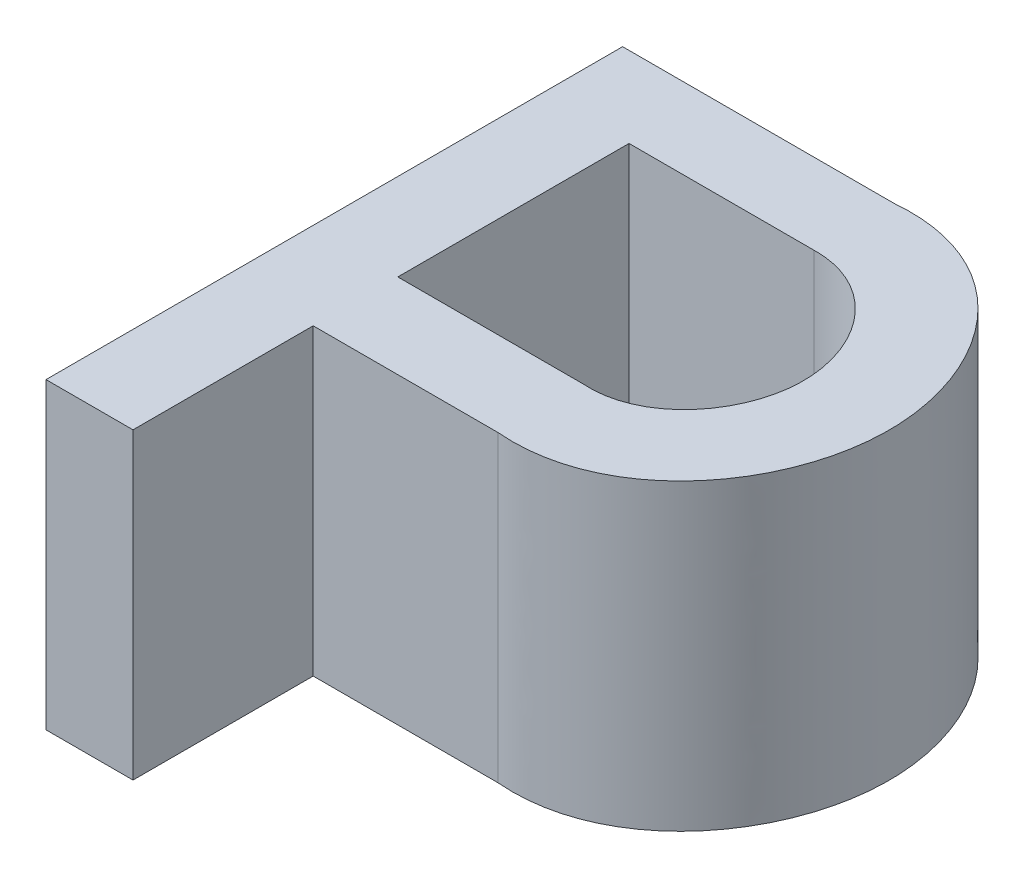
ISO-10303-21;
HEADER;
FILE_DESCRIPTION(('STEP AP214'),'2;1');
FILE_NAME('part.step','',(''),(''),'','','');
FILE_SCHEMA(('AUTOMOTIVE_DESIGN { 1 0 10303 214 1 1 1 1 }'));
ENDSEC;
DATA;
#1=APPLICATION_CONTEXT('core data for automotive mechanical design processes');
#2=APPLICATION_PROTOCOL_DEFINITION('international standard','automotive_design',2000,#1);
#3=PRODUCT_CONTEXT('',#1,'mechanical');
#4=PRODUCT('Part','Part','',(#3));
#5=PRODUCT_RELATED_PRODUCT_CATEGORY('part','',(#4));
#6=PRODUCT_DEFINITION_FORMATION('','',#4);
#7=PRODUCT_DEFINITION_CONTEXT('part definition',#1,'design');
#8=PRODUCT_DEFINITION('design','',#6,#7);
#9=PRODUCT_DEFINITION_SHAPE('','',#8);
#10=(LENGTH_UNIT() NAMED_UNIT(*) SI_UNIT(.MILLI.,.METRE.));
#11=(NAMED_UNIT(*) PLANE_ANGLE_UNIT() SI_UNIT($,.RADIAN.));
#12=(NAMED_UNIT(*) SI_UNIT($,.STERADIAN.) SOLID_ANGLE_UNIT());
#13=UNCERTAINTY_MEASURE_WITH_UNIT(LENGTH_MEASURE(1.E-05),#10,'distance_accuracy_value','');
#14=(GEOMETRIC_REPRESENTATION_CONTEXT(3) GLOBAL_UNCERTAINTY_ASSIGNED_CONTEXT((#13)) GLOBAL_UNIT_ASSIGNED_CONTEXT((#10,
#11,#12)) REPRESENTATION_CONTEXT('',''));
#15=CARTESIAN_POINT('',(0.,0.,0.));
#16=DIRECTION('',(0.,0.,1.));
#17=DIRECTION('',(1.,0.,0.));
#18=AXIS2_PLACEMENT_3D('',#15,#16,#17);
#19=CARTESIAN_POINT('',(44.9190314732042,10.,-68.762711537052));
#20=DIRECTION('',(0.,1.,0.));
#21=DIRECTION('',(0.,0.,1.));
#22=AXIS2_PLACEMENT_3D('',#19,#20,#21);
#23=PLANE('',#22);
#24=DIRECTION('',(1.,0.,0.));
#25=VECTOR('',#24,1.);
#26=CARTESIAN_POINT('',(32.4478409890386,10.,-56.28859622837));
#27=LINE('',#26,#25);
#28=CARTESIAN_POINT('',(29.5795112855339,10.,-56.28859622837));
#29=VERTEX_POINT('',#28);
#30=CARTESIAN_POINT('',(32.4478409890386,10.,-56.28859622837));
#31=VERTEX_POINT('',#30);
#32=EDGE_CURVE('E200',#29,#31,#27,.T.);
#33=ORIENTED_EDGE('',*,*,#32,.T.);
#34=DIRECTION('',(0.,0.,-1.));
#35=VECTOR('',#34,1.);
#36=CARTESIAN_POINT('',(32.4478409890386,10.,-62.2280252546941));
#37=LINE('',#36,#35);
#38=CARTESIAN_POINT('',(32.4478409890386,10.,-62.2280252546941));
#39=VERTEX_POINT('',#38);
#40=EDGE_CURVE('E230',#31,#39,#37,.T.);
#41=ORIENTED_EDGE('',*,*,#40,.T.);
#42=DIRECTION('',(1.,0.,0.));
#43=VECTOR('',#42,1.);
#44=CARTESIAN_POINT('',(38.5381300855212,10.,-62.2280252546941));
#45=LINE('',#44,#43);
#46=CARTESIAN_POINT('',(38.5381300855212,10.,-62.2280252546941));
#47=VERTEX_POINT('',#46);
#48=EDGE_CURVE('E174',#39,#47,#45,.T.);
#49=ORIENTED_EDGE('',*,*,#48,.T.);
#50=CARTESIAN_POINT('',(38.5381300855212,10.,-62.2280252546941));
#51=CARTESIAN_POINT('',(42.3650616606139,10.,-61.8988288068294));
#52=CARTESIAN_POINT('',(47.5226657401739,10.,-68.8002583260275));
#53=CARTESIAN_POINT('',(42.2655222882559,10.,-75.6400355835583));
#54=CARTESIAN_POINT('',(38.5381300855212,10.,-75.2974570796293));
#55=B_SPLINE_CURVE_WITH_KNOTS('',3,(#50,#51,#52,#53,#54),.UNSPECIFIED.,.F.,.F.,(4,1,4),(0.,
0.503221563541812,1.),.UNSPECIFIED.);
#56=CARTESIAN_POINT('',(38.5381300855212,10.,-75.2974570796293));
#57=VERTEX_POINT('',#56);
#58=EDGE_CURVE('E167',#47,#57,#55,.T.);
#59=ORIENTED_EDGE('',*,*,#58,.T.);
#60=DIRECTION('',(-1.,0.,0.));
#61=VECTOR('',#60,1.);
#62=CARTESIAN_POINT('',(29.5795112855339,10.,-75.2974570796293));
#63=LINE('',#62,#61);
#64=CARTESIAN_POINT('',(29.5795112855339,10.,-75.2974570796293));
#65=VERTEX_POINT('',#64);
#66=EDGE_CURVE('E173',#57,#65,#63,.T.);
#67=ORIENTED_EDGE('',*,*,#66,.T.);
#68=DIRECTION('',(0.,0.,1.));
#69=VECTOR('',#68,1.);
#70=CARTESIAN_POINT('',(29.5795112855339,10.,-56.28859622837));
#71=LINE('',#70,#69);
#72=EDGE_CURVE('E180',#65,#29,#71,.T.);
#73=ORIENTED_EDGE('',*,*,#72,.T.);
#74=EDGE_LOOP('',(#33,#41,#49,#59,#67,#73));
#75=FACE_BOUND('',#74,.T.);
#76=CARTESIAN_POINT('',(38.5381300855212,10.,-65.0177705827603));
#77=CARTESIAN_POINT('',(40.5489867379551,10.,-64.8708530082391));
#78=CARTESIAN_POINT('',(43.5948303713878,10.,-68.6567226095315));
#79=CARTESIAN_POINT('',(40.6554449119952,10.,-72.6802252522309));
#80=CARTESIAN_POINT('',(38.5381300855212,10.,-72.6404550002934));
#81=B_SPLINE_CURVE_WITH_KNOTS('',3,(#76,#77,#78,#79,#80),.UNSPECIFIED.,.F.,.F.,(4,1,4),(0.,
0.482841267605172,1.),.UNSPECIFIED.);
#82=CARTESIAN_POINT('',(38.5381300855212,10.,-65.0177705827603));
#83=VERTEX_POINT('',#82);
#84=CARTESIAN_POINT('',(38.5381300855212,10.,-72.6404550002934));
#85=VERTEX_POINT('',#84);
#86=EDGE_CURVE('E115',#83,#85,#81,.T.);
#87=ORIENTED_EDGE('',*,*,#86,.F.);
#88=DIRECTION('',(1.,0.,0.));
#89=VECTOR('',#88,1.);
#90=CARTESIAN_POINT('',(32.4478409890386,10.,-65.0177705827603));
#91=LINE('',#90,#89);
#92=CARTESIAN_POINT('',(32.4478409890386,10.,-65.0177705827603));
#93=VERTEX_POINT('',#92);
#94=EDGE_CURVE('E107',#93,#83,#91,.T.);
#95=ORIENTED_EDGE('',*,*,#94,.F.);
#96=DIRECTION('',(0.,0.,1.));
#97=VECTOR('',#96,1.);
#98=CARTESIAN_POINT('',(32.4478409890386,10.,-72.6404550002934));
#99=LINE('',#98,#97);
#100=CARTESIAN_POINT('',(32.4478409890386,10.,-72.6404550002934));
#101=VERTEX_POINT('',#100);
#102=EDGE_CURVE('E129',#101,#93,#99,.T.);
#103=ORIENTED_EDGE('',*,*,#102,.F.);
#104=DIRECTION('',(-1.,0.,0.));
#105=VECTOR('',#104,1.);
#106=CARTESIAN_POINT('',(38.5381300855212,10.,-72.6404550002934));
#107=LINE('',#106,#105);
#108=EDGE_CURVE('E127',#85,#101,#107,.T.);
#109=ORIENTED_EDGE('',*,*,#108,.F.);
#110=EDGE_LOOP('',(#87,#95,#103,#109));
#111=FACE_BOUND('',#110,.T.);
#112=ADVANCED_FACE('F30',(#75,#111),#23,.T.);
#113=CARTESIAN_POINT('',(44.9190314732042,0.,-68.762711537052));
#114=DIRECTION('',(0.,1.,0.));
#115=DIRECTION('',(0.,0.,1.));
#116=AXIS2_PLACEMENT_3D('',#113,#114,#115);
#117=PLANE('',#116);
#118=DIRECTION('',(1.,0.,0.));
#119=VECTOR('',#118,1.);
#120=CARTESIAN_POINT('',(32.4478409890386,0.,-56.28859622837));
#121=LINE('',#120,#119);
#122=CARTESIAN_POINT('',(29.5795112855339,0.,-56.28859622837));
#123=VERTEX_POINT('',#122);
#124=CARTESIAN_POINT('',(32.4478409890386,0.,-56.28859622837));
#125=VERTEX_POINT('',#124);
#126=EDGE_CURVE('E123',#123,#125,#121,.T.);
#127=ORIENTED_EDGE('',*,*,#126,.F.);
#128=DIRECTION('',(0.,0.,1.));
#129=VECTOR('',#128,1.);
#130=CARTESIAN_POINT('',(29.5795112855339,0.,-56.28859622837));
#131=LINE('',#130,#129);
#132=CARTESIAN_POINT('',(29.5795112855339,0.,-75.2974570796293));
#133=VERTEX_POINT('',#132);
#134=EDGE_CURVE('E198',#133,#123,#131,.T.);
#135=ORIENTED_EDGE('',*,*,#134,.F.);
#136=DIRECTION('',(-1.,0.,0.));
#137=VECTOR('',#136,1.);
#138=CARTESIAN_POINT('',(29.5795112855339,0.,-75.2974570796293));
#139=LINE('',#138,#137);
#140=CARTESIAN_POINT('',(38.5381300855212,0.,-75.2974570796293));
#141=VERTEX_POINT('',#140);
#142=EDGE_CURVE('E193',#141,#133,#139,.T.);
#143=ORIENTED_EDGE('',*,*,#142,.F.);
#144=CARTESIAN_POINT('',(38.5381300855212,0.,-62.2280252546941));
#145=CARTESIAN_POINT('',(42.3650616606139,0.,-61.8988288068294));
#146=CARTESIAN_POINT('',(47.5226657401739,0.,-68.8002583260275));
#147=CARTESIAN_POINT('',(42.2655222882559,0.,-75.6400355835583));
#148=CARTESIAN_POINT('',(38.5381300855212,0.,-75.2974570796293));
#149=B_SPLINE_CURVE_WITH_KNOTS('',3,(#144,#145,#146,#147,#148),.UNSPECIFIED.,.F.,.F.,(4,1,4),
(0.,0.503221563541812,1.),.UNSPECIFIED.);
#150=CARTESIAN_POINT('',(38.5381300855212,0.,-62.2280252546941));
#151=VERTEX_POINT('',#150);
#152=EDGE_CURVE('E189',#151,#141,#149,.T.);
#153=ORIENTED_EDGE('',*,*,#152,.F.);
#154=DIRECTION('',(1.,0.,0.));
#155=VECTOR('',#154,1.);
#156=CARTESIAN_POINT('',(38.5381300855212,0.,-62.2280252546941));
#157=LINE('',#156,#155);
#158=CARTESIAN_POINT('',(32.4478409890386,0.,-62.2280252546941));
#159=VERTEX_POINT('',#158);
#160=EDGE_CURVE('E187',#159,#151,#157,.T.);
#161=ORIENTED_EDGE('',*,*,#160,.F.);
#162=DIRECTION('',(0.,0.,-1.));
#163=VECTOR('',#162,1.);
#164=CARTESIAN_POINT('',(32.4478409890386,0.,-62.2280252546941));
#165=LINE('',#164,#163);
#166=EDGE_CURVE('E185',#125,#159,#165,.T.);
#167=ORIENTED_EDGE('',*,*,#166,.F.);
#168=EDGE_LOOP('',(#127,#135,#143,#153,#161,#167));
#169=FACE_BOUND('',#168,.T.);
#170=DIRECTION('',(1.,0.,0.));
#171=VECTOR('',#170,1.);
#172=CARTESIAN_POINT('',(32.4478409890386,0.,-65.0177705827603));
#173=LINE('',#172,#171);
#174=CARTESIAN_POINT('',(32.4478409890386,0.,-65.0177705827603));
#175=VERTEX_POINT('',#174);
#176=CARTESIAN_POINT('',(38.5381300855212,0.,-65.0177705827603));
#177=VERTEX_POINT('',#176);
#178=EDGE_CURVE('E53',#175,#177,#173,.T.);
#179=ORIENTED_EDGE('',*,*,#178,.T.);
#180=CARTESIAN_POINT('',(38.5381300855212,0.,-65.0177705827603));
#181=CARTESIAN_POINT('',(40.5489867379551,0.,-64.8708530082391));
#182=CARTESIAN_POINT('',(43.5948303713878,0.,-68.6567226095315));
#183=CARTESIAN_POINT('',(40.6554449119952,0.,-72.6802252522309));
#184=CARTESIAN_POINT('',(38.5381300855212,0.,-72.6404550002934));
#185=B_SPLINE_CURVE_WITH_KNOTS('',3,(#180,#181,#182,#183,#184),.UNSPECIFIED.,.F.,.F.,(4,1,4),
(0.,0.482841267605172,1.),.UNSPECIFIED.);
#186=CARTESIAN_POINT('',(38.5381300855212,0.,-72.6404550002934));
#187=VERTEX_POINT('',#186);
#188=EDGE_CURVE('E122',#177,#187,#185,.T.);
#189=ORIENTED_EDGE('',*,*,#188,.T.);
#190=DIRECTION('',(-1.,0.,0.));
#191=VECTOR('',#190,1.);
#192=CARTESIAN_POINT('',(38.5381300855212,0.,-72.6404550002934));
#193=LINE('',#192,#191);
#194=CARTESIAN_POINT('',(32.4478409890386,0.,-72.6404550002934));
#195=VERTEX_POINT('',#194);
#196=EDGE_CURVE('E238',#187,#195,#193,.T.);
#197=ORIENTED_EDGE('',*,*,#196,.T.);
#198=DIRECTION('',(0.,0.,1.));
#199=VECTOR('',#198,1.);
#200=CARTESIAN_POINT('',(32.4478409890386,0.,-72.6404550002934));
#201=LINE('',#200,#199);
#202=EDGE_CURVE('E116',#195,#175,#201,.T.);
#203=ORIENTED_EDGE('',*,*,#202,.T.);
#204=EDGE_LOOP('',(#179,#189,#197,#203));
#205=FACE_BOUND('',#204,.T.);
#206=ADVANCED_FACE('F149',(#169,#205),#117,.F.);
#207=CARTESIAN_POINT('',(32.4478409890386,10.,-56.28859622837));
#208=DIRECTION('',(0.,0.,-1.));
#209=DIRECTION('',(-1.,0.,0.));
#210=AXIS2_PLACEMENT_3D('',#207,#208,#209);
#211=PLANE('',#210);
#212=ORIENTED_EDGE('',*,*,#126,.T.);
#213=DIRECTION('',(0.,-1.,0.));
#214=VECTOR('',#213,1.);
#215=CARTESIAN_POINT('',(32.4478409890386,10.,-56.28859622837));
#216=LINE('',#215,#214);
#217=EDGE_CURVE('E11',#31,#125,#216,.T.);
#218=ORIENTED_EDGE('',*,*,#217,.F.);
#219=ORIENTED_EDGE('',*,*,#32,.F.);
#220=DIRECTION('',(0.,-1.,0.));
#221=VECTOR('',#220,1.);
#222=CARTESIAN_POINT('',(29.5795112855339,10.,-56.28859622837));
#223=LINE('',#222,#221);
#224=EDGE_CURVE('E182',#29,#123,#223,.T.);
#225=ORIENTED_EDGE('',*,*,#224,.T.);
#226=EDGE_LOOP('',(#212,#218,#219,#225));
#227=FACE_BOUND('',#226,.T.);
#228=ADVANCED_FACE('F32',(#227),#211,.F.);
#229=CARTESIAN_POINT('',(32.4478409890386,10.,-62.2280252546941));
#230=DIRECTION('',(-1.,0.,0.));
#231=DIRECTION('',(0.,0.,1.));
#232=AXIS2_PLACEMENT_3D('',#229,#230,#231);
#233=PLANE('',#232);
#234=ORIENTED_EDGE('',*,*,#166,.T.);
#235=DIRECTION('',(0.,-1.,0.));
#236=VECTOR('',#235,1.);
#237=CARTESIAN_POINT('',(32.4478409890386,10.,-62.2280252546941));
#238=LINE('',#237,#236);
#239=EDGE_CURVE('E38',#39,#159,#238,.T.);
#240=ORIENTED_EDGE('',*,*,#239,.F.);
#241=ORIENTED_EDGE('',*,*,#40,.F.);
#242=ORIENTED_EDGE('',*,*,#217,.T.);
#243=EDGE_LOOP('',(#234,#240,#241,#242));
#244=FACE_BOUND('',#243,.T.);
#245=ADVANCED_FACE('F262',(#244),#233,.F.);
#246=CARTESIAN_POINT('',(38.5381300855212,10.,-62.2280252546941));
#247=DIRECTION('',(0.,0.,-1.));
#248=DIRECTION('',(-1.,0.,0.));
#249=AXIS2_PLACEMENT_3D('',#246,#247,#248);
#250=PLANE('',#249);
#251=ORIENTED_EDGE('',*,*,#160,.T.);
#252=DIRECTION('',(0.,-1.,0.));
#253=VECTOR('',#252,1.);
#254=CARTESIAN_POINT('',(38.5381300855212,10.,-62.2280252546941));
#255=LINE('',#254,#253);
#256=EDGE_CURVE('E209',#47,#151,#255,.T.);
#257=ORIENTED_EDGE('',*,*,#256,.F.);
#258=ORIENTED_EDGE('',*,*,#48,.F.);
#259=ORIENTED_EDGE('',*,*,#239,.T.);
#260=EDGE_LOOP('',(#251,#257,#258,#259));
#261=FACE_BOUND('',#260,.T.);
#262=ADVANCED_FACE('F165',(#261),#250,.F.);
#263=DIRECTION('',(0.,-1.,0.));
#264=VECTOR('',#263,1.);
#265=SURFACE_OF_LINEAR_EXTRUSION('',#55,#264);
#266=ORIENTED_EDGE('',*,*,#152,.T.);
#267=DIRECTION('',(0.,-1.,0.));
#268=VECTOR('',#267,1.);
#269=CARTESIAN_POINT('',(38.5381300855212,10.,-75.2974570796293));
#270=LINE('',#269,#268);
#271=EDGE_CURVE('E206',#57,#141,#270,.T.);
#272=ORIENTED_EDGE('',*,*,#271,.F.);
#273=ORIENTED_EDGE('',*,*,#58,.F.);
#274=ORIENTED_EDGE('',*,*,#256,.T.);
#275=EDGE_LOOP('',(#266,#272,#273,#274));
#276=FACE_BOUND('',#275,.T.);
#277=ADVANCED_FACE('F160',(#276),#265,.F.);
#278=CARTESIAN_POINT('',(29.5795112855339,10.,-75.2974570796293));
#279=DIRECTION('',(0.,0.,1.));
#280=DIRECTION('',(1.,0.,0.));
#281=AXIS2_PLACEMENT_3D('',#278,#279,#280);
#282=PLANE('',#281);
#283=ORIENTED_EDGE('',*,*,#142,.T.);
#284=DIRECTION('',(0.,-1.,0.));
#285=VECTOR('',#284,1.);
#286=CARTESIAN_POINT('',(29.5795112855339,10.,-75.2974570796293));
#287=LINE('',#286,#285);
#288=EDGE_CURVE('E203',#65,#133,#287,.T.);
#289=ORIENTED_EDGE('',*,*,#288,.F.);
#290=ORIENTED_EDGE('',*,*,#66,.F.);
#291=ORIENTED_EDGE('',*,*,#271,.T.);
#292=EDGE_LOOP('',(#283,#289,#290,#291));
#293=FACE_BOUND('',#292,.T.);
#294=ADVANCED_FACE('F156',(#293),#282,.F.);
#295=CARTESIAN_POINT('',(29.5795112855339,10.,-56.28859622837));
#296=DIRECTION('',(1.,0.,0.));
#297=DIRECTION('',(0.,0.,-1.));
#298=AXIS2_PLACEMENT_3D('',#295,#296,#297);
#299=PLANE('',#298);
#300=ORIENTED_EDGE('',*,*,#134,.T.);
#301=ORIENTED_EDGE('',*,*,#224,.F.);
#302=ORIENTED_EDGE('',*,*,#72,.F.);
#303=ORIENTED_EDGE('',*,*,#288,.T.);
#304=EDGE_LOOP('',(#300,#301,#302,#303));
#305=FACE_BOUND('',#304,.T.);
#306=ADVANCED_FACE('F146',(#305),#299,.F.);
#307=CARTESIAN_POINT('',(32.4478409890386,10.,-65.0177705827603));
#308=DIRECTION('',(0.,0.,-1.));
#309=DIRECTION('',(-1.,0.,0.));
#310=AXIS2_PLACEMENT_3D('',#307,#308,#309);
#311=PLANE('',#310);
#312=ORIENTED_EDGE('',*,*,#178,.F.);
#313=DIRECTION('',(0.,-1.,0.));
#314=VECTOR('',#313,1.);
#315=CARTESIAN_POINT('',(32.4478409890386,10.,-65.0177705827603));
#316=LINE('',#315,#314);
#317=EDGE_CURVE('E111',#93,#175,#316,.T.);
#318=ORIENTED_EDGE('',*,*,#317,.F.);
#319=ORIENTED_EDGE('',*,*,#94,.T.);
#320=DIRECTION('',(0.,-1.,0.));
#321=VECTOR('',#320,1.);
#322=CARTESIAN_POINT('',(38.5381300855212,10.,-65.0177705827603));
#323=LINE('',#322,#321);
#324=EDGE_CURVE('E110',#83,#177,#323,.T.);
#325=ORIENTED_EDGE('',*,*,#324,.T.);
#326=EDGE_LOOP('',(#312,#318,#319,#325));
#327=FACE_BOUND('',#326,.T.);
#328=ADVANCED_FACE('F109',(#327),#311,.T.);
#329=DIRECTION('',(0.,-1.,0.));
#330=VECTOR('',#329,1.);
#331=SURFACE_OF_LINEAR_EXTRUSION('',#81,#330);
#332=ORIENTED_EDGE('',*,*,#188,.F.);
#333=ORIENTED_EDGE('',*,*,#324,.F.);
#334=ORIENTED_EDGE('',*,*,#86,.T.);
#335=DIRECTION('',(0.,-1.,0.));
#336=VECTOR('',#335,1.);
#337=CARTESIAN_POINT('',(38.5381300855212,10.,-72.6404550002934));
#338=LINE('',#337,#336);
#339=EDGE_CURVE('E124',#85,#187,#338,.T.);
#340=ORIENTED_EDGE('',*,*,#339,.T.);
#341=EDGE_LOOP('',(#332,#333,#334,#340));
#342=FACE_BOUND('',#341,.T.);
#343=ADVANCED_FACE('F119',(#342),#331,.T.);
#344=CARTESIAN_POINT('',(38.5381300855212,10.,-72.6404550002934));
#345=DIRECTION('',(0.,0.,1.));
#346=DIRECTION('',(1.,0.,0.));
#347=AXIS2_PLACEMENT_3D('',#344,#345,#346);
#348=PLANE('',#347);
#349=ORIENTED_EDGE('',*,*,#196,.F.);
#350=ORIENTED_EDGE('',*,*,#339,.F.);
#351=ORIENTED_EDGE('',*,*,#108,.T.);
#352=DIRECTION('',(0.,-1.,0.));
#353=VECTOR('',#352,1.);
#354=CARTESIAN_POINT('',(32.4478409890386,10.,-72.6404550002934));
#355=LINE('',#354,#353);
#356=EDGE_CURVE('E45',#101,#195,#355,.T.);
#357=ORIENTED_EDGE('',*,*,#356,.T.);
#358=EDGE_LOOP('',(#349,#350,#351,#357));
#359=FACE_BOUND('',#358,.T.);
#360=ADVANCED_FACE('F142',(#359),#348,.T.);
#361=CARTESIAN_POINT('',(32.4478409890386,10.,-72.6404550002934));
#362=DIRECTION('',(1.,0.,0.));
#363=DIRECTION('',(0.,0.,-1.));
#364=AXIS2_PLACEMENT_3D('',#361,#362,#363);
#365=PLANE('',#364);
#366=ORIENTED_EDGE('',*,*,#202,.F.);
#367=ORIENTED_EDGE('',*,*,#356,.F.);
#368=ORIENTED_EDGE('',*,*,#102,.T.);
#369=ORIENTED_EDGE('',*,*,#317,.T.);
#370=EDGE_LOOP('',(#366,#367,#368,#369));
#371=FACE_BOUND('',#370,.T.);
#372=ADVANCED_FACE('F247',(#371),#365,.T.);
#373=CLOSED_SHELL('',(#112,#206,#228,#245,#262,#277,#294,#306,#328,#343,#360,#372));
#374=MANIFOLD_SOLID_BREP('B2',#373);
#375=ADVANCED_BREP_SHAPE_REPRESENTATION('',(#18,#374),#14);
#376=SHAPE_DEFINITION_REPRESENTATION(#9,#375);
ENDSEC;
END-ISO-10303-21;
